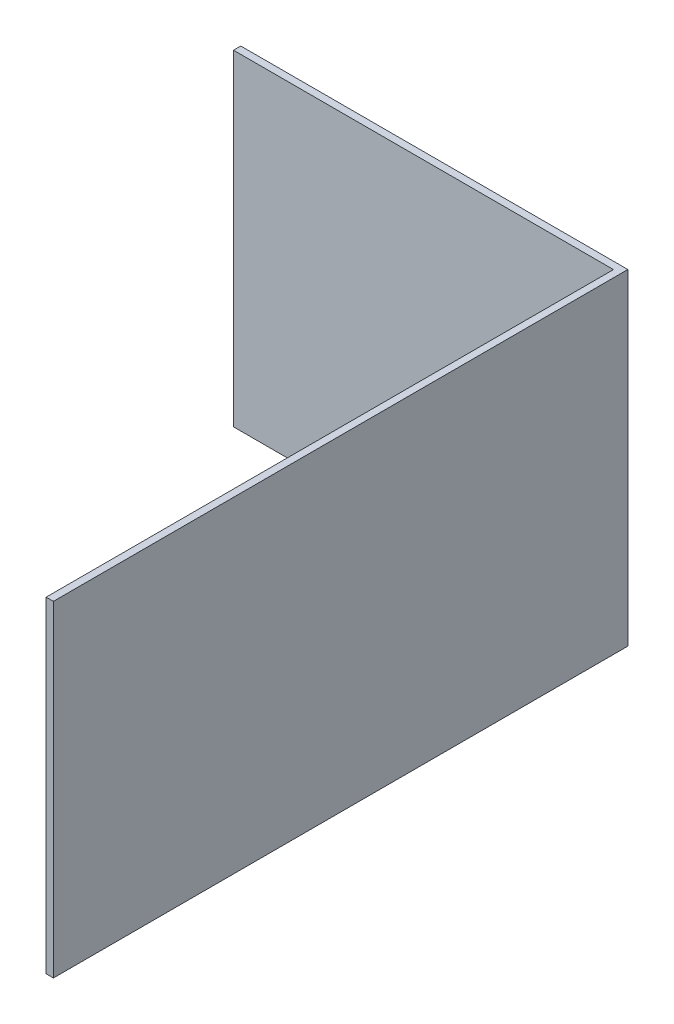
ISO-10303-21;
HEADER;
FILE_DESCRIPTION(('STEP AP214'),'2;1');
FILE_NAME('part.step','',(''),(''),'','','');
FILE_SCHEMA(('AUTOMOTIVE_DESIGN { 1 0 10303 214 1 1 1 1 }'));
ENDSEC;
DATA;
#1=APPLICATION_CONTEXT('core data for automotive mechanical design processes');
#2=APPLICATION_PROTOCOL_DEFINITION('international standard','automotive_design',2000,#1);
#3=PRODUCT_CONTEXT('',#1,'mechanical');
#4=PRODUCT('Part','Part','',(#3));
#5=PRODUCT_RELATED_PRODUCT_CATEGORY('part','',(#4));
#6=PRODUCT_DEFINITION_FORMATION('','',#4);
#7=PRODUCT_DEFINITION_CONTEXT('part definition',#1,'design');
#8=PRODUCT_DEFINITION('design','',#6,#7);
#9=PRODUCT_DEFINITION_SHAPE('','',#8);
#10=(LENGTH_UNIT() NAMED_UNIT(*) SI_UNIT(.MILLI.,.METRE.));
#11=(NAMED_UNIT(*) PLANE_ANGLE_UNIT() SI_UNIT($,.RADIAN.));
#12=(NAMED_UNIT(*) SI_UNIT($,.STERADIAN.) SOLID_ANGLE_UNIT());
#13=UNCERTAINTY_MEASURE_WITH_UNIT(LENGTH_MEASURE(1.E-05),#10,'distance_accuracy_value','');
#14=(GEOMETRIC_REPRESENTATION_CONTEXT(3) GLOBAL_UNCERTAINTY_ASSIGNED_CONTEXT((#13)) GLOBAL_UNIT_ASSIGNED_CONTEXT((#10,
#11,#12)) REPRESENTATION_CONTEXT('',''));
#15=CARTESIAN_POINT('',(0.,0.,0.));
#16=DIRECTION('',(0.,0.,1.));
#17=DIRECTION('',(1.,0.,0.));
#18=AXIS2_PLACEMENT_3D('',#15,#16,#17);
#19=CARTESIAN_POINT('',(359.999999999998,674.135566945079,-438.21063731441));
#20=DIRECTION('',(-0.999999965730541,0.,0.000261799384801581));
#21=DIRECTION('',(0.000261799384801581,0.,0.999999965730541));
#22=AXIS2_PLACEMENT_3D('',#19,#20,#21);
#23=PLANE('',#22);
#24=DIRECTION('',(-0.00026179938480158,0.,-0.999999965730541));
#25=VECTOR('',#24,1.);
#26=CARTESIAN_POINT('',(359.999999999998,0.,-438.21063731441));
#27=LINE('',#26,#25);
#28=CARTESIAN_POINT('',(360.310885989528,0.,749.286342905566));
#29=VERTEX_POINT('',#28);
#30=CARTESIAN_POINT('',(359.999999999998,0.,-438.21063731441));
#31=VERTEX_POINT('',#30);
#32=EDGE_CURVE('E117',#29,#31,#27,.T.);
#33=ORIENTED_EDGE('',*,*,#32,.T.);
#34=DIRECTION('',(0.,-1.,0.));
#35=VECTOR('',#34,1.);
#36=CARTESIAN_POINT('',(359.999999999998,674.135566945079,-438.21063731441));
#37=LINE('',#36,#35);
#38=CARTESIAN_POINT('',(359.999999999998,674.135566945079,-438.21063731441));
#39=VERTEX_POINT('',#38);
#40=EDGE_CURVE('E11',#39,#31,#37,.T.);
#41=ORIENTED_EDGE('',*,*,#40,.F.);
#42=DIRECTION('',(-0.00026179938480158,0.,-0.999999965730541));
#43=VECTOR('',#42,1.);
#44=CARTESIAN_POINT('',(359.999999999998,674.135566945079,-438.21063731441));
#45=LINE('',#44,#43);
#46=CARTESIAN_POINT('',(360.310885989528,674.135566945079,749.286342905566));
#47=VERTEX_POINT('',#46);
#48=EDGE_CURVE('E127',#47,#39,#45,.T.);
#49=ORIENTED_EDGE('',*,*,#48,.F.);
#50=DIRECTION('',(0.,-1.,0.));
#51=VECTOR('',#50,1.);
#52=CARTESIAN_POINT('',(360.310885989528,674.135566945079,749.286342905566));
#53=LINE('',#52,#51);
#54=EDGE_CURVE('E113',#47,#29,#53,.T.);
#55=ORIENTED_EDGE('',*,*,#54,.T.);
#56=EDGE_LOOP('',(#33,#41,#49,#55));
#57=FACE_BOUND('',#56,.T.);
#58=ADVANCED_FACE('F33',(#57),#23,.F.);
#59=CARTESIAN_POINT('',(-440.000000000002,674.135566945079,-438.21063731441));
#60=DIRECTION('',(0.,0.,1.));
#61=DIRECTION('',(1.,0.,0.));
#62=AXIS2_PLACEMENT_3D('',#59,#60,#61);
#63=PLANE('',#62);
#64=DIRECTION('',(-1.,0.,0.));
#65=VECTOR('',#64,1.);
#66=CARTESIAN_POINT('',(-440.000000000002,0.,-438.21063731441));
#67=LINE('',#66,#65);
#68=CARTESIAN_POINT('',(-440.000000000002,0.,-438.21063731441));
#69=VERTEX_POINT('',#68);
#70=EDGE_CURVE('E120',#31,#69,#67,.T.);
#71=ORIENTED_EDGE('',*,*,#70,.T.);
#72=DIRECTION('',(0.,-1.,0.));
#73=VECTOR('',#72,1.);
#74=CARTESIAN_POINT('',(-440.000000000002,674.135566945079,-438.21063731441));
#75=LINE('',#74,#73);
#76=CARTESIAN_POINT('',(-440.000000000002,674.135566945079,-438.21063731441));
#77=VERTEX_POINT('',#76);
#78=EDGE_CURVE('E41',#77,#69,#75,.T.);
#79=ORIENTED_EDGE('',*,*,#78,.F.);
#80=DIRECTION('',(-1.,0.,0.));
#81=VECTOR('',#80,1.);
#82=CARTESIAN_POINT('',(-440.000000000002,674.135566945079,-438.21063731441));
#83=LINE('',#82,#81);
#84=EDGE_CURVE('E86',#39,#77,#83,.T.);
#85=ORIENTED_EDGE('',*,*,#84,.F.);
#86=ORIENTED_EDGE('',*,*,#40,.T.);
#87=EDGE_LOOP('',(#71,#79,#85,#86));
#88=FACE_BOUND('',#87,.T.);
#89=ADVANCED_FACE('F151',(#88),#63,.F.);
#90=CARTESIAN_POINT('',(-440.000000000001,674.135566945079,-423.210637314775));
#91=DIRECTION('',(1.,0.,0.));
#92=DIRECTION('',(0.,0.,-1.));
#93=AXIS2_PLACEMENT_3D('',#90,#91,#92);
#94=PLANE('',#93);
#95=DIRECTION('',(0.,0.,1.));
#96=VECTOR('',#95,1.);
#97=CARTESIAN_POINT('',(-440.000000000001,0.,-423.210637314775));
#98=LINE('',#97,#96);
#99=CARTESIAN_POINT('',(-440.000000000001,0.,-423.210637314775));
#100=VERTEX_POINT('',#99);
#101=EDGE_CURVE('E122',#69,#100,#98,.T.);
#102=ORIENTED_EDGE('',*,*,#101,.T.);
#103=DIRECTION('',(0.,-1.,0.));
#104=VECTOR('',#103,1.);
#105=CARTESIAN_POINT('',(-440.000000000001,674.135566945079,-423.210637314775));
#106=LINE('',#105,#104);
#107=CARTESIAN_POINT('',(-440.000000000001,674.135566945079,-423.210637314775));
#108=VERTEX_POINT('',#107);
#109=EDGE_CURVE('E108',#108,#100,#106,.T.);
#110=ORIENTED_EDGE('',*,*,#109,.F.);
#111=DIRECTION('',(0.,0.,1.));
#112=VECTOR('',#111,1.);
#113=CARTESIAN_POINT('',(-440.000000000001,674.135566945079,-423.210637314775));
#114=LINE('',#113,#112);
#115=EDGE_CURVE('E99',#77,#108,#114,.T.);
#116=ORIENTED_EDGE('',*,*,#115,.F.);
#117=ORIENTED_EDGE('',*,*,#78,.T.);
#118=EDGE_LOOP('',(#102,#110,#116,#117));
#119=FACE_BOUND('',#118,.T.);
#120=ADVANCED_FACE('F133',(#119),#94,.F.);
#121=CARTESIAN_POINT('',(345.31088598953,674.135566945079,-423.210637314775));
#122=DIRECTION('',(0.,0.,-1.));
#123=DIRECTION('',(-1.,0.,0.));
#124=AXIS2_PLACEMENT_3D('',#121,#122,#123);
#125=PLANE('',#124);
#126=DIRECTION('',(1.,0.,0.));
#127=VECTOR('',#126,1.);
#128=CARTESIAN_POINT('',(345.31088598953,0.,-423.210637314775));
#129=LINE('',#128,#127);
#130=CARTESIAN_POINT('',(345.31088598953,0.,-423.210637314775));
#131=VERTEX_POINT('',#130);
#132=EDGE_CURVE('E107',#100,#131,#129,.T.);
#133=ORIENTED_EDGE('',*,*,#132,.T.);
#134=DIRECTION('',(0.,-1.,0.));
#135=VECTOR('',#134,1.);
#136=CARTESIAN_POINT('',(345.31088598953,674.135566945079,-423.210637314775));
#137=LINE('',#136,#135);
#138=CARTESIAN_POINT('',(345.31088598953,674.135566945079,-423.210637314775));
#139=VERTEX_POINT('',#138);
#140=EDGE_CURVE('E104',#139,#131,#137,.T.);
#141=ORIENTED_EDGE('',*,*,#140,.F.);
#142=DIRECTION('',(1.,0.,0.));
#143=VECTOR('',#142,1.);
#144=CARTESIAN_POINT('',(345.31088598953,674.135566945079,-423.210637314775));
#145=LINE('',#144,#143);
#146=EDGE_CURVE('E93',#108,#139,#145,.T.);
#147=ORIENTED_EDGE('',*,*,#146,.F.);
#148=ORIENTED_EDGE('',*,*,#109,.T.);
#149=EDGE_LOOP('',(#133,#141,#147,#148));
#150=FACE_BOUND('',#149,.T.);
#151=ADVANCED_FACE('F105',(#150),#125,.F.);
#152=CARTESIAN_POINT('',(345.310885989528,674.135566945079,749.286342905566));
#153=DIRECTION('',(1.,0.,0.));
#154=DIRECTION('',(0.,0.,-1.));
#155=AXIS2_PLACEMENT_3D('',#152,#153,#154);
#156=PLANE('',#155);
#157=DIRECTION('',(0.,0.,1.));
#158=VECTOR('',#157,1.);
#159=CARTESIAN_POINT('',(345.310885989528,0.,749.286342905566));
#160=LINE('',#159,#158);
#161=CARTESIAN_POINT('',(345.310885989528,0.,749.286342905566));
#162=VERTEX_POINT('',#161);
#163=EDGE_CURVE('E72',#131,#162,#160,.T.);
#164=ORIENTED_EDGE('',*,*,#163,.T.);
#165=DIRECTION('',(0.,-1.,0.));
#166=VECTOR('',#165,1.);
#167=CARTESIAN_POINT('',(345.310885989528,674.135566945079,749.286342905566));
#168=LINE('',#167,#166);
#169=CARTESIAN_POINT('',(345.310885989528,674.135566945079,749.286342905566));
#170=VERTEX_POINT('',#169);
#171=EDGE_CURVE('E109',#170,#162,#168,.T.);
#172=ORIENTED_EDGE('',*,*,#171,.F.);
#173=DIRECTION('',(0.,0.,1.));
#174=VECTOR('',#173,1.);
#175=CARTESIAN_POINT('',(345.310885989528,674.135566945079,749.286342905566));
#176=LINE('',#175,#174);
#177=EDGE_CURVE('E97',#139,#170,#176,.T.);
#178=ORIENTED_EDGE('',*,*,#177,.F.);
#179=ORIENTED_EDGE('',*,*,#140,.T.);
#180=EDGE_LOOP('',(#164,#172,#178,#179));
#181=FACE_BOUND('',#180,.T.);
#182=ADVANCED_FACE('F111',(#181),#156,.F.);
#183=CARTESIAN_POINT('',(345.310885989528,674.135566945079,749.286342905566));
#184=DIRECTION('',(0.,0.,-1.));
#185=DIRECTION('',(-1.,0.,0.));
#186=AXIS2_PLACEMENT_3D('',#183,#184,#185);
#187=PLANE('',#186);
#188=DIRECTION('',(1.,0.,0.));
#189=VECTOR('',#188,1.);
#190=CARTESIAN_POINT('',(345.310885989528,0.,749.286342905566));
#191=LINE('',#190,#189);
#192=EDGE_CURVE('E78',#162,#29,#191,.T.);
#193=ORIENTED_EDGE('',*,*,#192,.T.);
#194=ORIENTED_EDGE('',*,*,#54,.F.);
#195=DIRECTION('',(1.,0.,0.));
#196=VECTOR('',#195,1.);
#197=CARTESIAN_POINT('',(345.310885989528,674.135566945079,749.286342905566));
#198=LINE('',#197,#196);
#199=EDGE_CURVE('E49',#170,#47,#198,.T.);
#200=ORIENTED_EDGE('',*,*,#199,.F.);
#201=ORIENTED_EDGE('',*,*,#171,.T.);
#202=EDGE_LOOP('',(#193,#194,#200,#201));
#203=FACE_BOUND('',#202,.T.);
#204=ADVANCED_FACE('F140',(#203),#187,.F.);
#205=CARTESIAN_POINT('',(0.,674.135566945079,0.));
#206=DIRECTION('',(0.,1.,0.));
#207=DIRECTION('',(0.,0.,1.));
#208=AXIS2_PLACEMENT_3D('',#205,#206,#207);
#209=PLANE('',#208);
#210=ORIENTED_EDGE('',*,*,#48,.T.);
#211=ORIENTED_EDGE('',*,*,#84,.T.);
#212=ORIENTED_EDGE('',*,*,#115,.T.);
#213=ORIENTED_EDGE('',*,*,#146,.T.);
#214=ORIENTED_EDGE('',*,*,#177,.T.);
#215=ORIENTED_EDGE('',*,*,#199,.T.);
#216=EDGE_LOOP('',(#210,#211,#212,#213,#214,#215));
#217=FACE_BOUND('',#216,.T.);
#218=ADVANCED_FACE('F95',(#217),#209,.T.);
#219=CARTESIAN_POINT('',(0.,0.,0.));
#220=DIRECTION('',(0.,1.,0.));
#221=DIRECTION('',(0.,0.,1.));
#222=AXIS2_PLACEMENT_3D('',#219,#220,#221);
#223=PLANE('',#222);
#224=ORIENTED_EDGE('',*,*,#32,.F.);
#225=ORIENTED_EDGE('',*,*,#192,.F.);
#226=ORIENTED_EDGE('',*,*,#163,.F.);
#227=ORIENTED_EDGE('',*,*,#132,.F.);
#228=ORIENTED_EDGE('',*,*,#101,.F.);
#229=ORIENTED_EDGE('',*,*,#70,.F.);
#230=EDGE_LOOP('',(#224,#225,#226,#227,#228,#229));
#231=FACE_BOUND('',#230,.T.);
#232=ADVANCED_FACE('F136',(#231),#223,.F.);
#233=CLOSED_SHELL('',(#58,#89,#120,#151,#182,#204,#218,#232));
#234=MANIFOLD_SOLID_BREP('B2',#233);
#235=ADVANCED_BREP_SHAPE_REPRESENTATION('',(#18,#234),#14);
#236=SHAPE_DEFINITION_REPRESENTATION(#9,#235);
ENDSEC;
END-ISO-10303-21;
